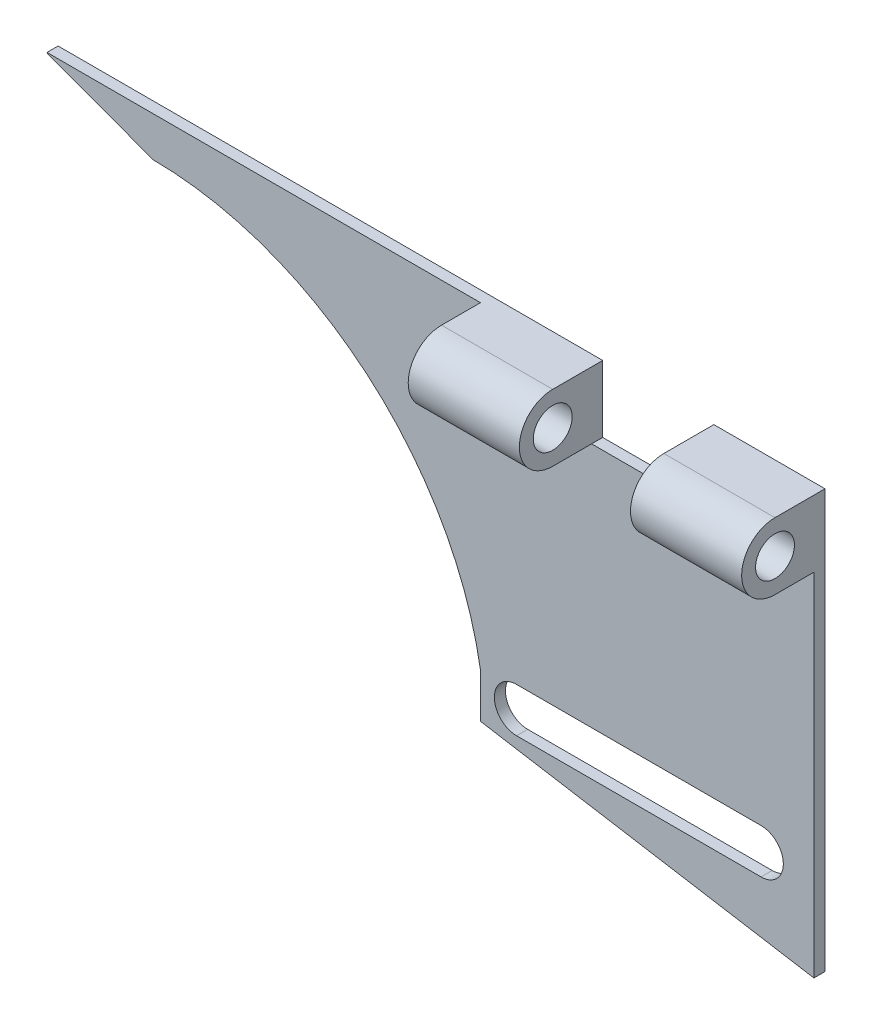
ISO-10303-21;
HEADER;
FILE_DESCRIPTION(('STEP AP214'),'2;1');
FILE_NAME('part.step','',(''),(''),'','','');
FILE_SCHEMA(('AUTOMOTIVE_DESIGN { 1 0 10303 214 1 1 1 1 }'));
ENDSEC;
DATA;
#1=APPLICATION_CONTEXT('core data for automotive mechanical design processes');
#2=APPLICATION_PROTOCOL_DEFINITION('international standard','automotive_design',2000,#1);
#3=PRODUCT_CONTEXT('',#1,'mechanical');
#4=PRODUCT('Part','Part','',(#3));
#5=PRODUCT_RELATED_PRODUCT_CATEGORY('part','',(#4));
#6=PRODUCT_DEFINITION_FORMATION('','',#4);
#7=PRODUCT_DEFINITION_CONTEXT('part definition',#1,'design');
#8=PRODUCT_DEFINITION('design','',#6,#7);
#9=PRODUCT_DEFINITION_SHAPE('','',#8);
#10=(LENGTH_UNIT() NAMED_UNIT(*) SI_UNIT(.MILLI.,.METRE.));
#11=(NAMED_UNIT(*) PLANE_ANGLE_UNIT() SI_UNIT($,.RADIAN.));
#12=(NAMED_UNIT(*) SI_UNIT($,.STERADIAN.) SOLID_ANGLE_UNIT());
#13=UNCERTAINTY_MEASURE_WITH_UNIT(LENGTH_MEASURE(1.E-05),#10,'distance_accuracy_value','');
#14=(GEOMETRIC_REPRESENTATION_CONTEXT(3) GLOBAL_UNCERTAINTY_ASSIGNED_CONTEXT((#13)) GLOBAL_UNIT_ASSIGNED_CONTEXT((#10,
#11,#12)) REPRESENTATION_CONTEXT('',''));
#15=CARTESIAN_POINT('',(0.,0.,0.));
#16=DIRECTION('',(0.,0.,1.));
#17=DIRECTION('',(1.,0.,0.));
#18=AXIS2_PLACEMENT_3D('',#15,#16,#17);
#19=CARTESIAN_POINT('',(-34.5,18.81,1.));
#20=DIRECTION('',(0.,1.,0.));
#21=DIRECTION('',(-1.,0.,0.));
#22=AXIS2_PLACEMENT_3D('',#19,#20,#21);
#23=PLANE('',#22);
#24=DIRECTION('',(1.,0.,0.));
#25=VECTOR('',#24,1.);
#26=CARTESIAN_POINT('',(-34.5,18.81,0.));
#27=LINE('',#26,#25);
#28=CARTESIAN_POINT('',(24.5,18.81,0.));
#29=VERTEX_POINT('',#28);
#30=CARTESIAN_POINT('',(34.5,18.81,0.));
#31=VERTEX_POINT('',#30);
#32=EDGE_CURVE('E192',#29,#31,#27,.T.);
#33=ORIENTED_EDGE('',*,*,#32,.F.);
#34=DIRECTION('',(0.,0.,1.));
#35=VECTOR('',#34,1.);
#36=CARTESIAN_POINT('',(24.5,18.81,1.));
#37=LINE('',#36,#35);
#38=CARTESIAN_POINT('',(24.5,18.81,4.5));
#39=VERTEX_POINT('',#38);
#40=EDGE_CURVE('E269',#29,#39,#37,.T.);
#41=ORIENTED_EDGE('',*,*,#40,.T.);
#42=DIRECTION('',(1.,0.,0.));
#43=VECTOR('',#42,1.);
#44=CARTESIAN_POINT('',(24.5,18.81,4.5));
#45=LINE('',#44,#43);
#46=CARTESIAN_POINT('',(34.5,18.81,4.5));
#47=VERTEX_POINT('',#46);
#48=EDGE_CURVE('E291',#39,#47,#45,.T.);
#49=ORIENTED_EDGE('',*,*,#48,.T.);
#50=DIRECTION('',(0.,0.,-1.));
#51=VECTOR('',#50,1.);
#52=CARTESIAN_POINT('',(34.5,18.81,1.));
#53=LINE('',#52,#51);
#54=EDGE_CURVE('E216',#47,#31,#53,.T.);
#55=ORIENTED_EDGE('',*,*,#54,.T.);
#56=EDGE_LOOP('',(#33,#41,#49,#55));
#57=FACE_BOUND('',#56,.T.);
#58=ADVANCED_FACE('F34',(#57),#23,.T.);
#59=CARTESIAN_POINT('',(-25.0856136994558,-14.7790504149759,1.));
#60=DIRECTION('',(0.,0.,-1.));
#61=DIRECTION('',(-1.,0.,0.));
#62=AXIS2_PLACEMENT_3D('',#59,#60,#61);
#63=PLANE('',#62);
#64=DIRECTION('',(1.,0.,0.));
#65=VECTOR('',#64,1.);
#66=CARTESIAN_POINT('',(29.75,-13.31,1.));
#67=LINE('',#66,#65);
#68=CARTESIAN_POINT('',(7.75000000000001,-13.31,1.));
#69=VERTEX_POINT('',#68);
#70=CARTESIAN_POINT('',(29.75,-13.31,1.));
#71=VERTEX_POINT('',#70);
#72=EDGE_CURVE('E320',#69,#71,#67,.T.);
#73=ORIENTED_EDGE('',*,*,#72,.F.);
#74=CARTESIAN_POINT('',(7.75,-11.31,1.));
#75=DIRECTION('',(0.,0.,1.));
#76=DIRECTION('',(1.,0.,0.));
#77=AXIS2_PLACEMENT_3D('',#74,#75,#76);
#78=CIRCLE('',#77,2.);
#79=CARTESIAN_POINT('',(7.75,-9.31,1.));
#80=VERTEX_POINT('',#79);
#81=EDGE_CURVE('E302',#80,#69,#78,.T.);
#82=ORIENTED_EDGE('',*,*,#81,.F.);
#83=DIRECTION('',(-1.,0.,0.));
#84=VECTOR('',#83,1.);
#85=CARTESIAN_POINT('',(7.75,-9.31,1.));
#86=LINE('',#85,#84);
#87=CARTESIAN_POINT('',(29.75,-9.31,1.));
#88=VERTEX_POINT('',#87);
#89=EDGE_CURVE('E309',#88,#80,#86,.T.);
#90=ORIENTED_EDGE('',*,*,#89,.F.);
#91=CARTESIAN_POINT('',(29.75,-11.31,1.));
#92=DIRECTION('',(0.,0.,1.));
#93=DIRECTION('',(-1.,0.,0.));
#94=AXIS2_PLACEMENT_3D('',#91,#92,#93);
#95=CIRCLE('',#94,2.);
#96=EDGE_CURVE('E323',#71,#88,#95,.T.);
#97=ORIENTED_EDGE('',*,*,#96,.F.);
#98=EDGE_LOOP('',(#73,#82,#90,#97));
#99=FACE_BOUND('',#98,.T.);
#100=DIRECTION('',(0.,1.,0.));
#101=VECTOR('',#100,1.);
#102=CARTESIAN_POINT('',(-34.5,14.81,1.));
#103=LINE('',#102,#101);
#104=CARTESIAN_POINT('',(-34.5,18.7654039618547,1.));
#105=VERTEX_POINT('',#104);
#106=CARTESIAN_POINT('',(-34.5,18.81,1.));
#107=VERTEX_POINT('',#106);
#108=EDGE_CURVE('E207',#105,#107,#103,.T.);
#109=ORIENTED_EDGE('',*,*,#108,.F.);
#110=DIRECTION('',(-0.937451280255772,0.348116499388946,0.));
#111=VECTOR('',#110,1.);
#112=CARTESIAN_POINT('',(-24.9542795391054,15.2206621059521,1.));
#113=LINE('',#112,#111);
#114=CARTESIAN_POINT('',(-24.9542795391054,15.2206621059521,1.));
#115=VERTEX_POINT('',#114);
#116=EDGE_CURVE('E11',#105,#115,#113,.F.);
#117=ORIENTED_EDGE('',*,*,#116,.T.);
#118=CARTESIAN_POINT('',(-25.0856136994558,-14.7790504149759,1.));
#119=DIRECTION('',(0.,0.,-1.));
#120=DIRECTION('',(-1.,0.,0.));
#121=AXIS2_PLACEMENT_3D('',#118,#119,#120);
#122=CIRCLE('',#121,30.);
#123=CARTESIAN_POINT('',(4.5,-9.81,1.));
#124=VERTEX_POINT('',#123);
#125=EDGE_CURVE('E221',#115,#124,#122,.T.);
#126=ORIENTED_EDGE('',*,*,#125,.T.);
#127=DIRECTION('',(0.,1.,0.));
#128=VECTOR('',#127,1.);
#129=CARTESIAN_POINT('',(4.5,-13.81,1.));
#130=LINE('',#129,#128);
#131=CARTESIAN_POINT('',(4.5,-13.81,1.));
#132=VERTEX_POINT('',#131);
#133=EDGE_CURVE('E235',#132,#124,#130,.T.);
#134=ORIENTED_EDGE('',*,*,#133,.F.);
#135=DIRECTION('',(0.986393923832144,-0.164398987305357,0.));
#136=VECTOR('',#135,1.);
#137=CARTESIAN_POINT('',(4.5,-13.81,1.));
#138=LINE('',#137,#136);
#139=CARTESIAN_POINT('',(34.5,-18.81,1.));
#140=VERTEX_POINT('',#139);
#141=EDGE_CURVE('E225',#132,#140,#138,.T.);
#142=ORIENTED_EDGE('',*,*,#141,.T.);
#143=DIRECTION('',(0.,-1.,0.));
#144=VECTOR('',#143,1.);
#145=CARTESIAN_POINT('',(34.5,18.81,1.));
#146=LINE('',#145,#144);
#147=CARTESIAN_POINT('',(34.5,12.81,1.));
#148=VERTEX_POINT('',#147);
#149=EDGE_CURVE('E222',#148,#140,#146,.T.);
#150=ORIENTED_EDGE('',*,*,#149,.F.);
#151=DIRECTION('',(1.,0.,0.));
#152=VECTOR('',#151,1.);
#153=CARTESIAN_POINT('',(24.5,12.81,1.));
#154=LINE('',#153,#152);
#155=CARTESIAN_POINT('',(24.5,12.81,1.));
#156=VERTEX_POINT('',#155);
#157=EDGE_CURVE('E258',#156,#148,#154,.T.);
#158=ORIENTED_EDGE('',*,*,#157,.F.);
#159=DIRECTION('',(1.,0.,0.));
#160=VECTOR('',#159,1.);
#161=CARTESIAN_POINT('',(14.5,12.81,1.));
#162=LINE('',#161,#160);
#163=CARTESIAN_POINT('',(14.5,12.81,1.));
#164=VERTEX_POINT('',#163);
#165=EDGE_CURVE('E370',#164,#156,#162,.T.);
#166=ORIENTED_EDGE('',*,*,#165,.F.);
#167=DIRECTION('',(1.,0.,0.));
#168=VECTOR('',#167,1.);
#169=CARTESIAN_POINT('',(4.5,12.81,1.));
#170=LINE('',#169,#168);
#171=CARTESIAN_POINT('',(4.5,12.81,1.));
#172=VERTEX_POINT('',#171);
#173=EDGE_CURVE('E273',#172,#164,#170,.T.);
#174=ORIENTED_EDGE('',*,*,#173,.F.);
#175=DIRECTION('',(0.,1.,0.));
#176=VECTOR('',#175,1.);
#177=CARTESIAN_POINT('',(4.5,18.81,1.));
#178=LINE('',#177,#176);
#179=CARTESIAN_POINT('',(4.5,18.81,1.));
#180=VERTEX_POINT('',#179);
#181=EDGE_CURVE('E340',#172,#180,#178,.T.);
#182=ORIENTED_EDGE('',*,*,#181,.T.);
#183=DIRECTION('',(1.,0.,0.));
#184=VECTOR('',#183,1.);
#185=CARTESIAN_POINT('',(-34.5,18.81,1.));
#186=LINE('',#185,#184);
#187=EDGE_CURVE('E226',#107,#180,#186,.T.);
#188=ORIENTED_EDGE('',*,*,#187,.F.);
#189=EDGE_LOOP('',(#109,#117,#126,#134,#142,#150,#158,#166,#174,#182,#188));
#190=FACE_BOUND('',#189,.T.);
#191=ADVANCED_FACE('F241',(#99,#190),#63,.F.);
#192=CARTESIAN_POINT('',(-34.5,14.81,1.));
#193=DIRECTION('',(-1.,0.,0.));
#194=DIRECTION('',(0.,0.,1.));
#195=AXIS2_PLACEMENT_3D('',#192,#193,#194);
#196=PLANE('',#195);
#197=DIRECTION('',(0.,1.,0.));
#198=VECTOR('',#197,1.);
#199=CARTESIAN_POINT('',(-34.5,14.81,0.));
#200=LINE('',#199,#198);
#201=CARTESIAN_POINT('',(-34.5,18.7654039618547,0.));
#202=VERTEX_POINT('',#201);
#203=CARTESIAN_POINT('',(-34.5,18.81,0.));
#204=VERTEX_POINT('',#203);
#205=EDGE_CURVE('E189',#202,#204,#200,.T.);
#206=ORIENTED_EDGE('',*,*,#205,.F.);
#207=DIRECTION('',(0.,0.,1.));
#208=VECTOR('',#207,1.);
#209=CARTESIAN_POINT('',(-34.5,18.7654039618547,1.));
#210=LINE('',#209,#208);
#211=EDGE_CURVE('E42',#202,#105,#210,.T.);
#212=ORIENTED_EDGE('',*,*,#211,.T.);
#213=ORIENTED_EDGE('',*,*,#108,.T.);
#214=DIRECTION('',(0.,0.,-1.));
#215=VECTOR('',#214,1.);
#216=CARTESIAN_POINT('',(-34.5,18.81,1.));
#217=LINE('',#216,#215);
#218=EDGE_CURVE('E219',#107,#204,#217,.T.);
#219=ORIENTED_EDGE('',*,*,#218,.T.);
#220=EDGE_LOOP('',(#206,#212,#213,#219));
#221=FACE_BOUND('',#220,.T.);
#222=ADVANCED_FACE('F404',(#221),#196,.T.);
#223=CARTESIAN_POINT('',(-25.0856136994558,-14.7790504149759,1.));
#224=DIRECTION('',(0.,0.,-1.));
#225=DIRECTION('',(-1.,0.,0.));
#226=AXIS2_PLACEMENT_3D('',#223,#224,#225);
#227=CYLINDRICAL_SURFACE('',#226,30.);
#228=ORIENTED_EDGE('',*,*,#125,.F.);
#229=DIRECTION('',(0.,0.,-1.));
#230=VECTOR('',#229,1.);
#231=CARTESIAN_POINT('',(-24.9542795391054,15.2206621059521,1.));
#232=LINE('',#231,#230);
#233=CARTESIAN_POINT('',(-24.9542795391054,15.2206621059521,0.));
#234=VERTEX_POINT('',#233);
#235=EDGE_CURVE('E211',#115,#234,#232,.T.);
#236=ORIENTED_EDGE('',*,*,#235,.T.);
#237=CARTESIAN_POINT('',(-25.0856136994558,-14.7790504149759,0.));
#238=DIRECTION('',(0.,0.,-1.));
#239=DIRECTION('',(-1.,0.,0.));
#240=AXIS2_PLACEMENT_3D('',#237,#238,#239);
#241=CIRCLE('',#240,30.);
#242=CARTESIAN_POINT('',(4.5,-9.81,0.));
#243=VERTEX_POINT('',#242);
#244=EDGE_CURVE('E205',#234,#243,#241,.T.);
#245=ORIENTED_EDGE('',*,*,#244,.T.);
#246=DIRECTION('',(0.,0.,-1.));
#247=VECTOR('',#246,1.);
#248=CARTESIAN_POINT('',(4.5,-9.81,1.));
#249=LINE('',#248,#247);
#250=EDGE_CURVE('E208',#124,#243,#249,.T.);
#251=ORIENTED_EDGE('',*,*,#250,.F.);
#252=EDGE_LOOP('',(#228,#236,#245,#251));
#253=FACE_BOUND('',#252,.T.);
#254=ADVANCED_FACE('F246',(#253),#227,.F.);
#255=CARTESIAN_POINT('',(4.5,-13.81,1.));
#256=DIRECTION('',(-1.,0.,0.));
#257=DIRECTION('',(0.,0.,1.));
#258=AXIS2_PLACEMENT_3D('',#255,#256,#257);
#259=PLANE('',#258);
#260=DIRECTION('',(0.,1.,0.));
#261=VECTOR('',#260,1.);
#262=CARTESIAN_POINT('',(4.5,-13.81,0.));
#263=LINE('',#262,#261);
#264=CARTESIAN_POINT('',(4.5,-13.81,0.));
#265=VERTEX_POINT('',#264);
#266=EDGE_CURVE('E202',#265,#243,#263,.T.);
#267=ORIENTED_EDGE('',*,*,#266,.F.);
#268=DIRECTION('',(0.,0.,-1.));
#269=VECTOR('',#268,1.);
#270=CARTESIAN_POINT('',(4.5,-13.81,1.));
#271=LINE('',#270,#269);
#272=EDGE_CURVE('E212',#132,#265,#271,.T.);
#273=ORIENTED_EDGE('',*,*,#272,.F.);
#274=ORIENTED_EDGE('',*,*,#133,.T.);
#275=ORIENTED_EDGE('',*,*,#250,.T.);
#276=EDGE_LOOP('',(#267,#273,#274,#275));
#277=FACE_BOUND('',#276,.T.);
#278=ADVANCED_FACE('F249',(#277),#259,.T.);
#279=CARTESIAN_POINT('',(4.5,-13.81,1.));
#280=DIRECTION('',(0.164398987305357,0.986393923832144,0.));
#281=DIRECTION('',(-0.986393923832144,0.164398987305357,0.));
#282=AXIS2_PLACEMENT_3D('',#279,#280,#281);
#283=PLANE('',#282);
#284=DIRECTION('',(0.986393923832144,-0.164398987305357,0.));
#285=VECTOR('',#284,1.);
#286=CARTESIAN_POINT('',(4.5,-13.81,0.));
#287=LINE('',#286,#285);
#288=CARTESIAN_POINT('',(34.5,-18.81,0.));
#289=VERTEX_POINT('',#288);
#290=EDGE_CURVE('E195',#265,#289,#287,.T.);
#291=ORIENTED_EDGE('',*,*,#290,.T.);
#292=DIRECTION('',(0.,0.,-1.));
#293=VECTOR('',#292,1.);
#294=CARTESIAN_POINT('',(34.5,-18.81,1.));
#295=LINE('',#294,#293);
#296=EDGE_CURVE('E214',#140,#289,#295,.T.);
#297=ORIENTED_EDGE('',*,*,#296,.F.);
#298=ORIENTED_EDGE('',*,*,#141,.F.);
#299=ORIENTED_EDGE('',*,*,#272,.T.);
#300=EDGE_LOOP('',(#291,#297,#298,#299));
#301=FACE_BOUND('',#300,.T.);
#302=ADVANCED_FACE('F254',(#301),#283,.F.);
#303=CARTESIAN_POINT('',(34.5,18.81,1.));
#304=DIRECTION('',(1.,0.,0.));
#305=DIRECTION('',(0.,0.,-1.));
#306=AXIS2_PLACEMENT_3D('',#303,#304,#305);
#307=PLANE('',#306);
#308=CARTESIAN_POINT('',(34.5,15.81,4.5));
#309=DIRECTION('',(1.,0.,0.));
#310=DIRECTION('',(0.,0.,-1.));
#311=AXIS2_PLACEMENT_3D('',#308,#309,#310);
#312=CIRCLE('',#311,1.75);
#313=CARTESIAN_POINT('',(34.5,15.81,2.75));
#314=VERTEX_POINT('',#313);
#315=EDGE_CURVE('E184',#314,#314,#312,.T.);
#316=ORIENTED_EDGE('',*,*,#315,.F.);
#317=EDGE_LOOP('',(#316));
#318=FACE_BOUND('',#317,.T.);
#319=DIRECTION('',(0.,-1.,0.));
#320=VECTOR('',#319,1.);
#321=CARTESIAN_POINT('',(34.5,18.81,0.));
#322=LINE('',#321,#320);
#323=EDGE_CURVE('E191',#31,#289,#322,.T.);
#324=ORIENTED_EDGE('',*,*,#323,.F.);
#325=ORIENTED_EDGE('',*,*,#54,.F.);
#326=CARTESIAN_POINT('',(34.5,15.81,4.5));
#327=DIRECTION('',(1.,0.,0.));
#328=DIRECTION('',(0.,0.,1.));
#329=AXIS2_PLACEMENT_3D('',#326,#327,#328);
#330=CIRCLE('',#329,3.);
#331=CARTESIAN_POINT('',(34.5,12.81,4.5));
#332=VERTEX_POINT('',#331);
#333=EDGE_CURVE('E267',#47,#332,#330,.T.);
#334=ORIENTED_EDGE('',*,*,#333,.T.);
#335=DIRECTION('',(0.,0.,-1.));
#336=VECTOR('',#335,1.);
#337=CARTESIAN_POINT('',(34.5,12.81,1.));
#338=LINE('',#337,#336);
#339=EDGE_CURVE('E265',#332,#148,#338,.T.);
#340=ORIENTED_EDGE('',*,*,#339,.T.);
#341=ORIENTED_EDGE('',*,*,#149,.T.);
#342=ORIENTED_EDGE('',*,*,#296,.T.);
#343=EDGE_LOOP('',(#324,#325,#334,#340,#341,#342));
#344=FACE_BOUND('',#343,.T.);
#345=ADVANCED_FACE('F262',(#318,#344),#307,.T.);
#346=DIRECTION('',(0.,0.,1.));
#347=VECTOR('',#346,1.);
#348=CARTESIAN_POINT('',(14.5,18.81,1.));
#349=LINE('',#348,#347);
#350=CARTESIAN_POINT('',(14.5,18.81,0.));
#351=VERTEX_POINT('',#350);
#352=CARTESIAN_POINT('',(14.5,18.81,4.5));
#353=VERTEX_POINT('',#352);
#354=EDGE_CURVE('E163',#351,#353,#349,.T.);
#355=ORIENTED_EDGE('',*,*,#354,.F.);
#356=EDGE_CURVE('E168',#204,#351,#27,.T.);
#357=ORIENTED_EDGE('',*,*,#356,.F.);
#358=ORIENTED_EDGE('',*,*,#218,.F.);
#359=ORIENTED_EDGE('',*,*,#187,.T.);
#360=DIRECTION('',(0.,0.,1.));
#361=VECTOR('',#360,1.);
#362=CARTESIAN_POINT('',(4.5,18.81,1.));
#363=LINE('',#362,#361);
#364=CARTESIAN_POINT('',(4.5,18.81,4.5));
#365=VERTEX_POINT('',#364);
#366=EDGE_CURVE('E337',#180,#365,#363,.T.);
#367=ORIENTED_EDGE('',*,*,#366,.T.);
#368=DIRECTION('',(1.,0.,0.));
#369=VECTOR('',#368,1.);
#370=CARTESIAN_POINT('',(4.5,18.81,4.5));
#371=LINE('',#370,#369);
#372=EDGE_CURVE('E170',#365,#353,#371,.T.);
#373=ORIENTED_EDGE('',*,*,#372,.T.);
#374=EDGE_LOOP('',(#355,#357,#358,#359,#367,#373));
#375=FACE_BOUND('',#374,.T.);
#376=ADVANCED_FACE('F165',(#375),#23,.T.);
#377=CARTESIAN_POINT('',(-25.0856136994558,-14.7790504149759,0.));
#378=DIRECTION('',(0.,0.,-1.));
#379=DIRECTION('',(-1.,0.,0.));
#380=AXIS2_PLACEMENT_3D('',#377,#378,#379);
#381=PLANE('',#380);
#382=ORIENTED_EDGE('',*,*,#244,.F.);
#383=DIRECTION('',(0.937451280255772,-0.348116499388946,0.));
#384=VECTOR('',#383,1.);
#385=CARTESIAN_POINT('',(-15.2795240321348,11.6280039161722,0.));
#386=LINE('',#385,#384);
#387=EDGE_CURVE('E56',#234,#202,#386,.F.);
#388=ORIENTED_EDGE('',*,*,#387,.T.);
#389=ORIENTED_EDGE('',*,*,#205,.T.);
#390=ORIENTED_EDGE('',*,*,#356,.T.);
#391=DIRECTION('',(0.,-1.,0.));
#392=VECTOR('',#391,1.);
#393=CARTESIAN_POINT('',(14.5,18.81,0.));
#394=LINE('',#393,#392);
#395=CARTESIAN_POINT('',(14.5,12.81,0.));
#396=VERTEX_POINT('',#395);
#397=EDGE_CURVE('E179',#351,#396,#394,.T.);
#398=ORIENTED_EDGE('',*,*,#397,.T.);
#399=DIRECTION('',(1.,0.,0.));
#400=VECTOR('',#399,1.);
#401=CARTESIAN_POINT('',(14.5,12.81,0.));
#402=LINE('',#401,#400);
#403=CARTESIAN_POINT('',(24.5,12.81,0.));
#404=VERTEX_POINT('',#403);
#405=EDGE_CURVE('E374',#396,#404,#402,.T.);
#406=ORIENTED_EDGE('',*,*,#405,.T.);
#407=DIRECTION('',(0.,1.,0.));
#408=VECTOR('',#407,1.);
#409=CARTESIAN_POINT('',(24.5,12.81,0.));
#410=LINE('',#409,#408);
#411=EDGE_CURVE('E367',#404,#29,#410,.T.);
#412=ORIENTED_EDGE('',*,*,#411,.T.);
#413=ORIENTED_EDGE('',*,*,#32,.T.);
#414=ORIENTED_EDGE('',*,*,#323,.T.);
#415=ORIENTED_EDGE('',*,*,#290,.F.);
#416=ORIENTED_EDGE('',*,*,#266,.T.);
#417=EDGE_LOOP('',(#382,#388,#389,#390,#398,#406,#412,#413,#414,#415,#416));
#418=FACE_BOUND('',#417,.T.);
#419=CARTESIAN_POINT('',(7.75,-11.31,0.));
#420=DIRECTION('',(0.,0.,1.));
#421=DIRECTION('',(1.,0.,0.));
#422=AXIS2_PLACEMENT_3D('',#419,#420,#421);
#423=CIRCLE('',#422,2.);
#424=CARTESIAN_POINT('',(7.75,-9.31,0.));
#425=VERTEX_POINT('',#424);
#426=CARTESIAN_POINT('',(7.75,-13.31,0.));
#427=VERTEX_POINT('',#426);
#428=EDGE_CURVE('E305',#425,#427,#423,.T.);
#429=ORIENTED_EDGE('',*,*,#428,.T.);
#430=DIRECTION('',(1.,0.,0.));
#431=VECTOR('',#430,1.);
#432=CARTESIAN_POINT('',(29.75,-13.31,0.));
#433=LINE('',#432,#431);
#434=CARTESIAN_POINT('',(29.75,-13.31,0.));
#435=VERTEX_POINT('',#434);
#436=EDGE_CURVE('E308',#427,#435,#433,.T.);
#437=ORIENTED_EDGE('',*,*,#436,.T.);
#438=CARTESIAN_POINT('',(29.75,-11.31,0.));
#439=DIRECTION('',(0.,0.,1.));
#440=DIRECTION('',(-1.,0.,0.));
#441=AXIS2_PLACEMENT_3D('',#438,#439,#440);
#442=CIRCLE('',#441,2.);
#443=CARTESIAN_POINT('',(29.75,-9.31,0.));
#444=VERTEX_POINT('',#443);
#445=EDGE_CURVE('E312',#435,#444,#442,.T.);
#446=ORIENTED_EDGE('',*,*,#445,.T.);
#447=DIRECTION('',(-1.,0.,0.));
#448=VECTOR('',#447,1.);
#449=CARTESIAN_POINT('',(7.75,-9.31,0.));
#450=LINE('',#449,#448);
#451=EDGE_CURVE('E315',#444,#425,#450,.T.);
#452=ORIENTED_EDGE('',*,*,#451,.T.);
#453=EDGE_LOOP('',(#429,#437,#446,#452));
#454=FACE_BOUND('',#453,.T.);
#455=ADVANCED_FACE('F187',(#418,#454),#381,.T.);
#456=CARTESIAN_POINT('',(7.75,-11.31,0.));
#457=DIRECTION('',(0.,0.,1.));
#458=DIRECTION('',(1.,0.,0.));
#459=AXIS2_PLACEMENT_3D('',#456,#457,#458);
#460=CYLINDRICAL_SURFACE('',#459,2.);
#461=ORIENTED_EDGE('',*,*,#81,.T.);
#462=DIRECTION('',(0.,0.,1.));
#463=VECTOR('',#462,1.);
#464=CARTESIAN_POINT('',(7.75,-13.31,0.));
#465=LINE('',#464,#463);
#466=EDGE_CURVE('E318',#427,#69,#465,.T.);
#467=ORIENTED_EDGE('',*,*,#466,.F.);
#468=ORIENTED_EDGE('',*,*,#428,.F.);
#469=DIRECTION('',(0.,0.,1.));
#470=VECTOR('',#469,1.);
#471=CARTESIAN_POINT('',(7.75,-9.31,0.));
#472=LINE('',#471,#470);
#473=EDGE_CURVE('E328',#425,#80,#472,.T.);
#474=ORIENTED_EDGE('',*,*,#473,.T.);
#475=EDGE_LOOP('',(#461,#467,#468,#474));
#476=FACE_BOUND('',#475,.T.);
#477=ADVANCED_FACE('F413',(#476),#460,.F.);
#478=CARTESIAN_POINT('',(7.75,-9.31,0.));
#479=DIRECTION('',(0.,1.,0.));
#480=DIRECTION('',(0.,0.,1.));
#481=AXIS2_PLACEMENT_3D('',#478,#479,#480);
#482=PLANE('',#481);
#483=ORIENTED_EDGE('',*,*,#89,.T.);
#484=ORIENTED_EDGE('',*,*,#473,.F.);
#485=ORIENTED_EDGE('',*,*,#451,.F.);
#486=DIRECTION('',(0.,0.,1.));
#487=VECTOR('',#486,1.);
#488=CARTESIAN_POINT('',(29.75,-9.31,0.));
#489=LINE('',#488,#487);
#490=EDGE_CURVE('E330',#444,#88,#489,.T.);
#491=ORIENTED_EDGE('',*,*,#490,.T.);
#492=EDGE_LOOP('',(#483,#484,#485,#491));
#493=FACE_BOUND('',#492,.T.);
#494=ADVANCED_FACE('F428',(#493),#482,.F.);
#495=CARTESIAN_POINT('',(29.75,-11.31,0.));
#496=DIRECTION('',(0.,0.,1.));
#497=DIRECTION('',(1.,0.,0.));
#498=AXIS2_PLACEMENT_3D('',#495,#496,#497);
#499=CYLINDRICAL_SURFACE('',#498,2.);
#500=ORIENTED_EDGE('',*,*,#96,.T.);
#501=ORIENTED_EDGE('',*,*,#490,.F.);
#502=ORIENTED_EDGE('',*,*,#445,.F.);
#503=DIRECTION('',(0.,0.,1.));
#504=VECTOR('',#503,1.);
#505=CARTESIAN_POINT('',(29.75,-13.31,0.));
#506=LINE('',#505,#504);
#507=EDGE_CURVE('E332',#435,#71,#506,.T.);
#508=ORIENTED_EDGE('',*,*,#507,.T.);
#509=EDGE_LOOP('',(#500,#501,#502,#508));
#510=FACE_BOUND('',#509,.T.);
#511=ADVANCED_FACE('F433',(#510),#499,.F.);
#512=CARTESIAN_POINT('',(29.75,-13.31,0.));
#513=DIRECTION('',(0.,-1.,0.));
#514=DIRECTION('',(1.,0.,0.));
#515=AXIS2_PLACEMENT_3D('',#512,#513,#514);
#516=PLANE('',#515);
#517=ORIENTED_EDGE('',*,*,#72,.T.);
#518=ORIENTED_EDGE('',*,*,#507,.F.);
#519=ORIENTED_EDGE('',*,*,#436,.F.);
#520=ORIENTED_EDGE('',*,*,#466,.T.);
#521=EDGE_LOOP('',(#517,#518,#519,#520));
#522=FACE_BOUND('',#521,.T.);
#523=ADVANCED_FACE('F430',(#522),#516,.F.);
#524=CARTESIAN_POINT('',(24.5,12.81,1.));
#525=DIRECTION('',(0.,-1.,0.));
#526=DIRECTION('',(0.,0.,-1.));
#527=AXIS2_PLACEMENT_3D('',#524,#525,#526);
#528=PLANE('',#527);
#529=ORIENTED_EDGE('',*,*,#339,.F.);
#530=DIRECTION('',(1.,0.,0.));
#531=VECTOR('',#530,1.);
#532=CARTESIAN_POINT('',(24.5,12.81,4.5));
#533=LINE('',#532,#531);
#534=CARTESIAN_POINT('',(24.5,12.81,4.5));
#535=VERTEX_POINT('',#534);
#536=EDGE_CURVE('E295',#535,#332,#533,.T.);
#537=ORIENTED_EDGE('',*,*,#536,.F.);
#538=DIRECTION('',(0.,0.,-1.));
#539=VECTOR('',#538,1.);
#540=CARTESIAN_POINT('',(24.5,12.81,1.));
#541=LINE('',#540,#539);
#542=EDGE_CURVE('E296',#535,#156,#541,.T.);
#543=ORIENTED_EDGE('',*,*,#542,.T.);
#544=ORIENTED_EDGE('',*,*,#157,.T.);
#545=EDGE_LOOP('',(#529,#537,#543,#544));
#546=FACE_BOUND('',#545,.T.);
#547=ADVANCED_FACE('F362',(#546),#528,.T.);
#548=CARTESIAN_POINT('',(24.5,15.81,4.5));
#549=DIRECTION('',(1.,0.,0.));
#550=DIRECTION('',(0.,0.,-1.));
#551=AXIS2_PLACEMENT_3D('',#548,#549,#550);
#552=CYLINDRICAL_SURFACE('',#551,3.);
#553=ORIENTED_EDGE('',*,*,#333,.F.);
#554=ORIENTED_EDGE('',*,*,#48,.F.);
#555=CARTESIAN_POINT('',(24.5,15.81,4.5));
#556=DIRECTION('',(1.,0.,0.));
#557=DIRECTION('',(0.,0.,1.));
#558=AXIS2_PLACEMENT_3D('',#555,#556,#557);
#559=CIRCLE('',#558,3.);
#560=EDGE_CURVE('E272',#39,#535,#559,.T.);
#561=ORIENTED_EDGE('',*,*,#560,.T.);
#562=ORIENTED_EDGE('',*,*,#536,.T.);
#563=EDGE_LOOP('',(#553,#554,#561,#562));
#564=FACE_BOUND('',#563,.T.);
#565=ADVANCED_FACE('F298',(#564),#552,.T.);
#566=CARTESIAN_POINT('',(24.5,15.81,4.5));
#567=DIRECTION('',(-1.,0.,0.));
#568=DIRECTION('',(0.,0.,1.));
#569=AXIS2_PLACEMENT_3D('',#566,#567,#568);
#570=PLANE('',#569);
#571=CARTESIAN_POINT('',(24.5,15.81,4.5));
#572=DIRECTION('',(-1.,0.,0.));
#573=DIRECTION('',(0.,0.,1.));
#574=AXIS2_PLACEMENT_3D('',#571,#572,#573);
#575=CIRCLE('',#574,1.75);
#576=CARTESIAN_POINT('',(24.5,15.81,6.25));
#577=VERTEX_POINT('',#576);
#578=EDGE_CURVE('E175',#577,#577,#575,.T.);
#579=ORIENTED_EDGE('',*,*,#578,.F.);
#580=EDGE_LOOP('',(#579));
#581=FACE_BOUND('',#580,.T.);
#582=ORIENTED_EDGE('',*,*,#40,.F.);
#583=ORIENTED_EDGE('',*,*,#411,.F.);
#584=DIRECTION('',(0.,0.,1.));
#585=VECTOR('',#584,1.);
#586=CARTESIAN_POINT('',(24.5,12.81,-0.000999999999999916));
#587=LINE('',#586,#585);
#588=EDGE_CURVE('E185',#404,#156,#587,.T.);
#589=ORIENTED_EDGE('',*,*,#588,.T.);
#590=ORIENTED_EDGE('',*,*,#542,.F.);
#591=ORIENTED_EDGE('',*,*,#560,.F.);
#592=EDGE_LOOP('',(#582,#583,#589,#590,#591));
#593=FACE_BOUND('',#592,.T.);
#594=ADVANCED_FACE('F364',(#581,#593),#570,.T.);
#595=CARTESIAN_POINT('',(4.5,12.81,1.));
#596=DIRECTION('',(0.,-1.,0.));
#597=DIRECTION('',(0.,0.,-1.));
#598=AXIS2_PLACEMENT_3D('',#595,#596,#597);
#599=PLANE('',#598);
#600=DIRECTION('',(0.,0.,-1.));
#601=VECTOR('',#600,1.);
#602=CARTESIAN_POINT('',(14.5,12.81,1.));
#603=LINE('',#602,#601);
#604=CARTESIAN_POINT('',(14.5,12.81,4.5));
#605=VERTEX_POINT('',#604);
#606=EDGE_CURVE('E345',#605,#164,#603,.T.);
#607=ORIENTED_EDGE('',*,*,#606,.F.);
#608=DIRECTION('',(1.,0.,0.));
#609=VECTOR('',#608,1.);
#610=CARTESIAN_POINT('',(4.5,12.81,4.5));
#611=LINE('',#610,#609);
#612=CARTESIAN_POINT('',(4.5,12.81,4.5));
#613=VERTEX_POINT('',#612);
#614=EDGE_CURVE('E359',#613,#605,#611,.T.);
#615=ORIENTED_EDGE('',*,*,#614,.F.);
#616=DIRECTION('',(0.,0.,-1.));
#617=VECTOR('',#616,1.);
#618=CARTESIAN_POINT('',(4.5,12.81,1.));
#619=LINE('',#618,#617);
#620=EDGE_CURVE('E355',#613,#172,#619,.T.);
#621=ORIENTED_EDGE('',*,*,#620,.T.);
#622=ORIENTED_EDGE('',*,*,#173,.T.);
#623=EDGE_LOOP('',(#607,#615,#621,#622));
#624=FACE_BOUND('',#623,.T.);
#625=ADVANCED_FACE('F447',(#624),#599,.T.);
#626=CARTESIAN_POINT('',(4.5,15.81,4.5));
#627=DIRECTION('',(1.,0.,0.));
#628=DIRECTION('',(0.,0.,-1.));
#629=AXIS2_PLACEMENT_3D('',#626,#627,#628);
#630=CYLINDRICAL_SURFACE('',#629,3.);
#631=CARTESIAN_POINT('',(14.5,15.81,4.5));
#632=DIRECTION('',(1.,0.,0.));
#633=DIRECTION('',(0.,0.,1.));
#634=AXIS2_PLACEMENT_3D('',#631,#632,#633);
#635=CIRCLE('',#634,3.);
#636=EDGE_CURVE('E174',#353,#605,#635,.T.);
#637=ORIENTED_EDGE('',*,*,#636,.F.);
#638=ORIENTED_EDGE('',*,*,#372,.F.);
#639=CARTESIAN_POINT('',(4.5,15.81,4.5));
#640=DIRECTION('',(1.,0.,0.));
#641=DIRECTION('',(0.,0.,1.));
#642=AXIS2_PLACEMENT_3D('',#639,#640,#641);
#643=CIRCLE('',#642,3.);
#644=EDGE_CURVE('E347',#365,#613,#643,.T.);
#645=ORIENTED_EDGE('',*,*,#644,.T.);
#646=ORIENTED_EDGE('',*,*,#614,.T.);
#647=EDGE_LOOP('',(#637,#638,#645,#646));
#648=FACE_BOUND('',#647,.T.);
#649=ADVANCED_FACE('F396',(#648),#630,.T.);
#650=CARTESIAN_POINT('',(4.5,15.81,4.5));
#651=DIRECTION('',(-1.,0.,0.));
#652=DIRECTION('',(0.,0.,1.));
#653=AXIS2_PLACEMENT_3D('',#650,#651,#652);
#654=PLANE('',#653);
#655=CARTESIAN_POINT('',(4.5,15.81,4.5));
#656=DIRECTION('',(-1.,0.,0.));
#657=DIRECTION('',(0.,0.,1.));
#658=AXIS2_PLACEMENT_3D('',#655,#656,#657);
#659=CIRCLE('',#658,1.75);
#660=CARTESIAN_POINT('',(4.5,15.81,6.25));
#661=VERTEX_POINT('',#660);
#662=EDGE_CURVE('E284',#661,#661,#659,.F.);
#663=ORIENTED_EDGE('',*,*,#662,.T.);
#664=EDGE_LOOP('',(#663));
#665=FACE_BOUND('',#664,.T.);
#666=ORIENTED_EDGE('',*,*,#181,.F.);
#667=ORIENTED_EDGE('',*,*,#620,.F.);
#668=ORIENTED_EDGE('',*,*,#644,.F.);
#669=ORIENTED_EDGE('',*,*,#366,.F.);
#670=EDGE_LOOP('',(#666,#667,#668,#669));
#671=FACE_BOUND('',#670,.T.);
#672=ADVANCED_FACE('F382',(#665,#671),#654,.T.);
#673=CARTESIAN_POINT('',(14.5,15.81,4.5));
#674=DIRECTION('',(-1.,0.,0.));
#675=DIRECTION('',(0.,0.,1.));
#676=AXIS2_PLACEMENT_3D('',#673,#674,#675);
#677=PLANE('',#676);
#678=CARTESIAN_POINT('',(14.5,15.81,4.5));
#679=DIRECTION('',(-1.,0.,0.));
#680=DIRECTION('',(0.,0.,1.));
#681=AXIS2_PLACEMENT_3D('',#678,#679,#680);
#682=CIRCLE('',#681,1.75);
#683=CARTESIAN_POINT('',(14.5,15.81,6.25));
#684=VERTEX_POINT('',#683);
#685=EDGE_CURVE('E281',#684,#684,#682,.T.);
#686=ORIENTED_EDGE('',*,*,#685,.T.);
#687=EDGE_LOOP('',(#686));
#688=FACE_BOUND('',#687,.T.);
#689=ORIENTED_EDGE('',*,*,#606,.T.);
#690=DIRECTION('',(0.,0.,1.));
#691=VECTOR('',#690,1.);
#692=CARTESIAN_POINT('',(14.5,12.81,-0.000999999999999916));
#693=LINE('',#692,#691);
#694=EDGE_CURVE('E182',#396,#164,#693,.T.);
#695=ORIENTED_EDGE('',*,*,#694,.F.);
#696=ORIENTED_EDGE('',*,*,#397,.F.);
#697=ORIENTED_EDGE('',*,*,#354,.T.);
#698=ORIENTED_EDGE('',*,*,#636,.T.);
#699=EDGE_LOOP('',(#689,#695,#696,#697,#698));
#700=FACE_BOUND('',#699,.T.);
#701=ADVANCED_FACE('F181',(#688,#700),#677,.F.);
#702=CARTESIAN_POINT('',(-0.449747468305839,15.81,4.5));
#703=DIRECTION('',(1.,0.,0.));
#704=DIRECTION('',(0.,0.,-1.));
#705=AXIS2_PLACEMENT_3D('',#702,#703,#704);
#706=CYLINDRICAL_SURFACE('',#705,1.75);
#707=ORIENTED_EDGE('',*,*,#662,.F.);
#708=EDGE_LOOP('',(#707));
#709=FACE_BOUND('',#708,.T.);
#710=ORIENTED_EDGE('',*,*,#685,.F.);
#711=EDGE_LOOP('',(#710));
#712=FACE_BOUND('',#711,.T.);
#713=ADVANCED_FACE('F384',(#709,#712),#706,.F.);
#714=ORIENTED_EDGE('',*,*,#578,.T.);
#715=EDGE_LOOP('',(#714));
#716=FACE_BOUND('',#715,.T.);
#717=ORIENTED_EDGE('',*,*,#315,.T.);
#718=EDGE_LOOP('',(#717));
#719=FACE_BOUND('',#718,.T.);
#720=ADVANCED_FACE('F387',(#716,#719),#706,.F.);
#721=CARTESIAN_POINT('',(14.5,12.81,-0.000999999999999916));
#722=DIRECTION('',(0.,-1.,0.));
#723=DIRECTION('',(1.,0.,0.));
#724=AXIS2_PLACEMENT_3D('',#721,#722,#723);
#725=PLANE('',#724);
#726=ORIENTED_EDGE('',*,*,#694,.T.);
#727=ORIENTED_EDGE('',*,*,#165,.T.);
#728=ORIENTED_EDGE('',*,*,#588,.F.);
#729=ORIENTED_EDGE('',*,*,#405,.F.);
#730=EDGE_LOOP('',(#726,#727,#728,#729));
#731=FACE_BOUND('',#730,.T.);
#732=ADVANCED_FACE('F371',(#731),#725,.F.);
#733=CARTESIAN_POINT('',(-24.9542795391054,15.2206621059521,1.));
#734=DIRECTION('',(0.348116499388946,0.937451280255772,0.));
#735=DIRECTION('',(0.,0.,-1.));
#736=AXIS2_PLACEMENT_3D('',#733,#734,#735);
#737=PLANE('',#736);
#738=ORIENTED_EDGE('',*,*,#116,.F.);
#739=ORIENTED_EDGE('',*,*,#211,.F.);
#740=ORIENTED_EDGE('',*,*,#387,.F.);
#741=ORIENTED_EDGE('',*,*,#235,.F.);
#742=EDGE_LOOP('',(#738,#739,#740,#741));
#743=FACE_BOUND('',#742,.T.);
#744=ADVANCED_FACE('F36',(#743),#737,.F.);
#745=CLOSED_SHELL('',(#58,#191,#222,#254,#278,#302,#345,#376,#455,#477,#494,#511,#523,#547,#565,
#594,#625,#649,#672,#701,#713,#720,#732,#744));
#746=MANIFOLD_SOLID_BREP('B2',#745);
#747=ADVANCED_BREP_SHAPE_REPRESENTATION('',(#18,#746),#14);
#748=SHAPE_DEFINITION_REPRESENTATION(#9,#747);
ENDSEC;
END-ISO-10303-21;
